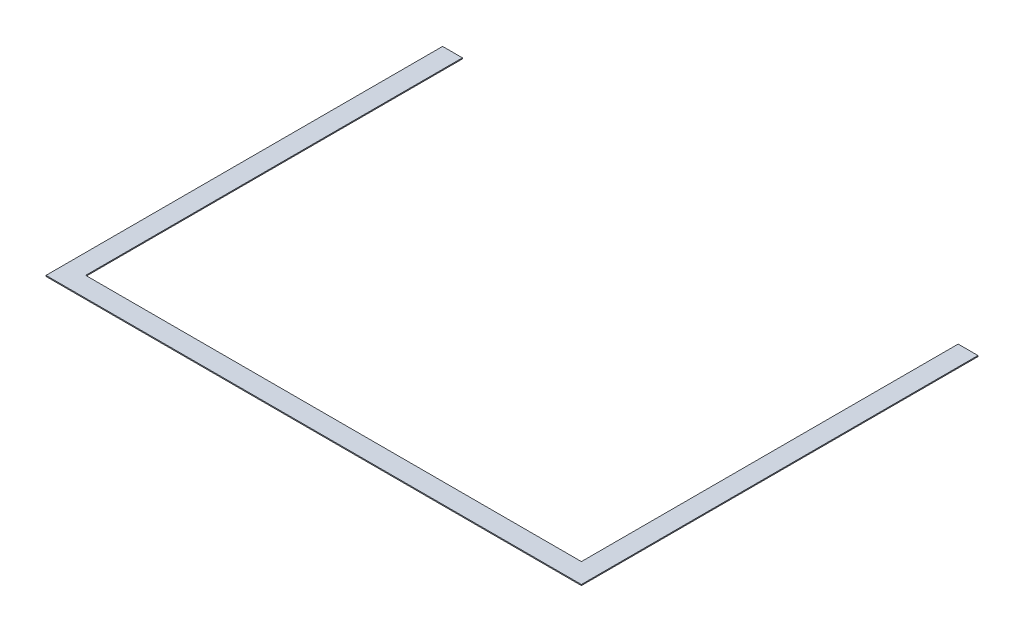
ISO-10303-21;
HEADER;
FILE_DESCRIPTION(('STEP AP214'),'2;1');
FILE_NAME('part.step','',(''),(''),'','','');
FILE_SCHEMA(('AUTOMOTIVE_DESIGN { 1 0 10303 214 1 1 1 1 }'));
ENDSEC;
DATA;
#1=APPLICATION_CONTEXT('core data for automotive mechanical design processes');
#2=APPLICATION_PROTOCOL_DEFINITION('international standard','automotive_design',2000,#1);
#3=PRODUCT_CONTEXT('',#1,'mechanical');
#4=PRODUCT('Part','Part','',(#3));
#5=PRODUCT_RELATED_PRODUCT_CATEGORY('part','',(#4));
#6=PRODUCT_DEFINITION_FORMATION('','',#4);
#7=PRODUCT_DEFINITION_CONTEXT('part definition',#1,'design');
#8=PRODUCT_DEFINITION('design','',#6,#7);
#9=PRODUCT_DEFINITION_SHAPE('','',#8);
#10=(LENGTH_UNIT() NAMED_UNIT(*) SI_UNIT(.MILLI.,.METRE.));
#11=(NAMED_UNIT(*) PLANE_ANGLE_UNIT() SI_UNIT($,.RADIAN.));
#12=(NAMED_UNIT(*) SI_UNIT($,.STERADIAN.) SOLID_ANGLE_UNIT());
#13=UNCERTAINTY_MEASURE_WITH_UNIT(LENGTH_MEASURE(1.E-05),#10,'distance_accuracy_value','');
#14=(GEOMETRIC_REPRESENTATION_CONTEXT(3) GLOBAL_UNCERTAINTY_ASSIGNED_CONTEXT((#13)) GLOBAL_UNIT_ASSIGNED_CONTEXT((#10,
#11,#12)) REPRESENTATION_CONTEXT('',''));
#15=CARTESIAN_POINT('',(0.,0.,0.));
#16=DIRECTION('',(0.,0.,1.));
#17=DIRECTION('',(1.,0.,0.));
#18=AXIS2_PLACEMENT_3D('',#15,#16,#17);
#19=CARTESIAN_POINT('',(2493.37884073959,5.,-1936.62115926041));
#20=DIRECTION('',(0.,0.,1.));
#21=DIRECTION('',(1.,0.,0.));
#22=AXIS2_PLACEMENT_3D('',#19,#20,#21);
#23=PLANE('',#22);
#24=DIRECTION('',(-1.,0.,0.));
#25=VECTOR('',#24,1.);
#26=CARTESIAN_POINT('',(2493.37884073959,0.,-1936.62115926041));
#27=LINE('',#26,#25);
#28=CARTESIAN_POINT('',(2593.37884073959,0.,-1936.62115926041));
#29=VERTEX_POINT('',#28);
#30=CARTESIAN_POINT('',(2493.37884073959,0.,-1936.62115926041));
#31=VERTEX_POINT('',#30);
#32=EDGE_CURVE('E146',#29,#31,#27,.T.);
#33=ORIENTED_EDGE('',*,*,#32,.T.);
#34=DIRECTION('',(0.,-1.,0.));
#35=VECTOR('',#34,1.);
#36=CARTESIAN_POINT('',(2493.37884073959,5.,-1936.62115926041));
#37=LINE('',#36,#35);
#38=CARTESIAN_POINT('',(2493.37884073959,5.,-1936.62115926041));
#39=VERTEX_POINT('',#38);
#40=EDGE_CURVE('E11',#39,#31,#37,.T.);
#41=ORIENTED_EDGE('',*,*,#40,.F.);
#42=DIRECTION('',(-1.,0.,0.));
#43=VECTOR('',#42,1.);
#44=CARTESIAN_POINT('',(2493.37884073959,5.,-1936.62115926041));
#45=LINE('',#44,#43);
#46=CARTESIAN_POINT('',(2593.37884073959,5.,-1936.62115926041));
#47=VERTEX_POINT('',#46);
#48=EDGE_CURVE('E168',#47,#39,#45,.T.);
#49=ORIENTED_EDGE('',*,*,#48,.F.);
#50=DIRECTION('',(0.,-1.,0.));
#51=VECTOR('',#50,1.);
#52=CARTESIAN_POINT('',(2593.37884073959,5.,-1936.62115926041));
#53=LINE('',#52,#51);
#54=EDGE_CURVE('E142',#47,#29,#53,.T.);
#55=ORIENTED_EDGE('',*,*,#54,.T.);
#56=EDGE_LOOP('',(#33,#41,#49,#55));
#57=FACE_BOUND('',#56,.T.);
#58=ADVANCED_FACE('F45',(#57),#23,.F.);
#59=CARTESIAN_POINT('',(2493.37884073959,5.,-36.6211592604097));
#60=DIRECTION('',(1.,0.,0.));
#61=DIRECTION('',(0.,0.,-1.));
#62=AXIS2_PLACEMENT_3D('',#59,#60,#61);
#63=PLANE('',#62);
#64=DIRECTION('',(0.,0.,1.));
#65=VECTOR('',#64,1.);
#66=CARTESIAN_POINT('',(2493.37884073959,0.,-36.6211592604097));
#67=LINE('',#66,#65);
#68=CARTESIAN_POINT('',(2493.37884073959,0.,-36.6211592604097));
#69=VERTEX_POINT('',#68);
#70=EDGE_CURVE('E150',#31,#69,#67,.T.);
#71=ORIENTED_EDGE('',*,*,#70,.T.);
#72=DIRECTION('',(0.,-1.,0.));
#73=VECTOR('',#72,1.);
#74=CARTESIAN_POINT('',(2493.37884073959,5.,-36.6211592604097));
#75=LINE('',#74,#73);
#76=CARTESIAN_POINT('',(2493.37884073959,5.,-36.6211592604097));
#77=VERTEX_POINT('',#76);
#78=EDGE_CURVE('E54',#77,#69,#75,.T.);
#79=ORIENTED_EDGE('',*,*,#78,.F.);
#80=DIRECTION('',(0.,0.,1.));
#81=VECTOR('',#80,1.);
#82=CARTESIAN_POINT('',(2493.37884073959,5.,-186.62115926041));
#83=LINE('',#82,#81);
#84=EDGE_CURVE('E105',#39,#77,#83,.T.);
#85=ORIENTED_EDGE('',*,*,#84,.F.);
#86=ORIENTED_EDGE('',*,*,#40,.T.);
#87=EDGE_LOOP('',(#71,#79,#85,#86));
#88=FACE_BOUND('',#87,.T.);
#89=ADVANCED_FACE('F214',(#88),#63,.F.);
#90=CARTESIAN_POINT('',(-6.62115926040992,5.,-36.6211592604097));
#91=DIRECTION('',(0.,0.,1.));
#92=DIRECTION('',(1.,0.,0.));
#93=AXIS2_PLACEMENT_3D('',#90,#91,#92);
#94=PLANE('',#93);
#95=DIRECTION('',(-1.,0.,0.));
#96=VECTOR('',#95,1.);
#97=CARTESIAN_POINT('',(-6.62115926040992,0.,-36.6211592604097));
#98=LINE('',#97,#96);
#99=CARTESIAN_POINT('',(-6.62115926040992,0.,-36.6211592604097));
#100=VERTEX_POINT('',#99);
#101=EDGE_CURVE('E153',#69,#100,#98,.T.);
#102=ORIENTED_EDGE('',*,*,#101,.T.);
#103=DIRECTION('',(0.,-1.,0.));
#104=VECTOR('',#103,1.);
#105=CARTESIAN_POINT('',(-6.62115926040992,5.,-36.6211592604097));
#106=LINE('',#105,#104);
#107=CARTESIAN_POINT('',(-6.62115926040992,5.,-36.6211592604097));
#108=VERTEX_POINT('',#107);
#109=EDGE_CURVE('E179',#108,#100,#106,.T.);
#110=ORIENTED_EDGE('',*,*,#109,.F.);
#111=DIRECTION('',(-1.,0.,0.));
#112=VECTOR('',#111,1.);
#113=CARTESIAN_POINT('',(-6.62115926040992,5.,-36.6211592604097));
#114=LINE('',#113,#112);
#115=EDGE_CURVE('E189',#77,#108,#114,.T.);
#116=ORIENTED_EDGE('',*,*,#115,.F.);
#117=ORIENTED_EDGE('',*,*,#78,.T.);
#118=EDGE_LOOP('',(#102,#110,#116,#117));
#119=FACE_BOUND('',#118,.T.);
#120=ADVANCED_FACE('F187',(#119),#94,.F.);
#121=CARTESIAN_POINT('',(-6.62115926040992,5.,-36.6211592604097));
#122=DIRECTION('',(-1.,0.,0.));
#123=DIRECTION('',(0.,0.,1.));
#124=AXIS2_PLACEMENT_3D('',#121,#122,#123);
#125=PLANE('',#124);
#126=DIRECTION('',(0.,0.,-1.));
#127=VECTOR('',#126,1.);
#128=CARTESIAN_POINT('',(-6.62115926040992,0.,-36.6211592604097));
#129=LINE('',#128,#127);
#130=CARTESIAN_POINT('',(-6.62115926040992,0.,-1936.62115926041));
#131=VERTEX_POINT('',#130);
#132=EDGE_CURVE('E156',#100,#131,#129,.T.);
#133=ORIENTED_EDGE('',*,*,#132,.T.);
#134=DIRECTION('',(0.,-1.,0.));
#135=VECTOR('',#134,1.);
#136=CARTESIAN_POINT('',(-6.62115926040992,5.,-1936.62115926041));
#137=LINE('',#136,#135);
#138=CARTESIAN_POINT('',(-6.62115926040992,5.,-1936.62115926041));
#139=VERTEX_POINT('',#138);
#140=EDGE_CURVE('E175',#139,#131,#137,.T.);
#141=ORIENTED_EDGE('',*,*,#140,.F.);
#142=DIRECTION('',(0.,0.,-1.));
#143=VECTOR('',#142,1.);
#144=CARTESIAN_POINT('',(-6.62115926040992,5.,-36.6211592604097));
#145=LINE('',#144,#143);
#146=EDGE_CURVE('E202',#108,#139,#145,.T.);
#147=ORIENTED_EDGE('',*,*,#146,.F.);
#148=ORIENTED_EDGE('',*,*,#109,.T.);
#149=EDGE_LOOP('',(#133,#141,#147,#148));
#150=FACE_BOUND('',#149,.T.);
#151=ADVANCED_FACE('F197',(#150),#125,.F.);
#152=CARTESIAN_POINT('',(-106.62115926041,5.,-1936.62115926041));
#153=DIRECTION('',(0.,0.,1.));
#154=DIRECTION('',(1.,0.,0.));
#155=AXIS2_PLACEMENT_3D('',#152,#153,#154);
#156=PLANE('',#155);
#157=DIRECTION('',(-1.,0.,0.));
#158=VECTOR('',#157,1.);
#159=CARTESIAN_POINT('',(-106.62115926041,0.,-1936.62115926041));
#160=LINE('',#159,#158);
#161=CARTESIAN_POINT('',(-106.62115926041,0.,-1936.62115926041));
#162=VERTEX_POINT('',#161);
#163=EDGE_CURVE('E159',#131,#162,#160,.T.);
#164=ORIENTED_EDGE('',*,*,#163,.T.);
#165=DIRECTION('',(0.,-1.,0.));
#166=VECTOR('',#165,1.);
#167=CARTESIAN_POINT('',(-106.62115926041,5.,-1936.62115926041));
#168=LINE('',#167,#166);
#169=CARTESIAN_POINT('',(-106.62115926041,5.,-1936.62115926041));
#170=VERTEX_POINT('',#169);
#171=EDGE_CURVE('E135',#170,#162,#168,.T.);
#172=ORIENTED_EDGE('',*,*,#171,.F.);
#173=DIRECTION('',(-1.,0.,0.));
#174=VECTOR('',#173,1.);
#175=CARTESIAN_POINT('',(-106.62115926041,5.,-1936.62115926041));
#176=LINE('',#175,#174);
#177=EDGE_CURVE('E124',#139,#170,#176,.T.);
#178=ORIENTED_EDGE('',*,*,#177,.F.);
#179=ORIENTED_EDGE('',*,*,#140,.T.);
#180=EDGE_LOOP('',(#164,#172,#178,#179));
#181=FACE_BOUND('',#180,.T.);
#182=ADVANCED_FACE('F200',(#181),#156,.F.);
#183=CARTESIAN_POINT('',(-106.62115926041,5.,63.3788407395903));
#184=DIRECTION('',(1.,0.,0.));
#185=DIRECTION('',(0.,0.,-1.));
#186=AXIS2_PLACEMENT_3D('',#183,#184,#185);
#187=PLANE('',#186);
#188=DIRECTION('',(0.,0.,1.));
#189=VECTOR('',#188,1.);
#190=CARTESIAN_POINT('',(-106.62115926041,0.,63.3788407395903));
#191=LINE('',#190,#189);
#192=CARTESIAN_POINT('',(-106.62115926041,0.,63.3788407395903));
#193=VERTEX_POINT('',#192);
#194=EDGE_CURVE('E133',#162,#193,#191,.T.);
#195=ORIENTED_EDGE('',*,*,#194,.T.);
#196=DIRECTION('',(0.,-1.,0.));
#197=VECTOR('',#196,1.);
#198=CARTESIAN_POINT('',(-106.62115926041,5.,63.3788407395903));
#199=LINE('',#198,#197);
#200=CARTESIAN_POINT('',(-106.62115926041,5.,63.3788407395903));
#201=VERTEX_POINT('',#200);
#202=EDGE_CURVE('E130',#201,#193,#199,.T.);
#203=ORIENTED_EDGE('',*,*,#202,.F.);
#204=DIRECTION('',(0.,0.,1.));
#205=VECTOR('',#204,1.);
#206=CARTESIAN_POINT('',(-106.62115926041,5.,63.3788407395903));
#207=LINE('',#206,#205);
#208=EDGE_CURVE('E118',#170,#201,#207,.T.);
#209=ORIENTED_EDGE('',*,*,#208,.F.);
#210=ORIENTED_EDGE('',*,*,#171,.T.);
#211=EDGE_LOOP('',(#195,#203,#209,#210));
#212=FACE_BOUND('',#211,.T.);
#213=ADVANCED_FACE('F131',(#212),#187,.F.);
#214=CARTESIAN_POINT('',(-106.62115926041,5.,63.3788407395903));
#215=DIRECTION('',(0.,0.,-1.));
#216=DIRECTION('',(-1.,0.,0.));
#217=AXIS2_PLACEMENT_3D('',#214,#215,#216);
#218=PLANE('',#217);
#219=DIRECTION('',(1.,0.,0.));
#220=VECTOR('',#219,1.);
#221=CARTESIAN_POINT('',(-106.62115926041,0.,63.3788407395903));
#222=LINE('',#221,#220);
#223=CARTESIAN_POINT('',(2593.37884073959,0.,63.3788407395903));
#224=VERTEX_POINT('',#223);
#225=EDGE_CURVE('E91',#193,#224,#222,.T.);
#226=ORIENTED_EDGE('',*,*,#225,.T.);
#227=DIRECTION('',(0.,-1.,0.));
#228=VECTOR('',#227,1.);
#229=CARTESIAN_POINT('',(2593.37884073959,5.,63.3788407395903));
#230=LINE('',#229,#228);
#231=CARTESIAN_POINT('',(2593.37884073959,5.,63.3788407395903));
#232=VERTEX_POINT('',#231);
#233=EDGE_CURVE('E136',#232,#224,#230,.T.);
#234=ORIENTED_EDGE('',*,*,#233,.F.);
#235=DIRECTION('',(1.,0.,0.));
#236=VECTOR('',#235,1.);
#237=CARTESIAN_POINT('',(-106.62115926041,5.,63.3788407395903));
#238=LINE('',#237,#236);
#239=EDGE_CURVE('E122',#201,#232,#238,.T.);
#240=ORIENTED_EDGE('',*,*,#239,.F.);
#241=ORIENTED_EDGE('',*,*,#202,.T.);
#242=EDGE_LOOP('',(#226,#234,#240,#241));
#243=FACE_BOUND('',#242,.T.);
#244=ADVANCED_FACE('F138',(#243),#218,.F.);
#245=CARTESIAN_POINT('',(2593.37884073959,5.,63.3788407395903));
#246=DIRECTION('',(-1.,0.,0.));
#247=DIRECTION('',(0.,0.,1.));
#248=AXIS2_PLACEMENT_3D('',#245,#246,#247);
#249=PLANE('',#248);
#250=DIRECTION('',(0.,0.,-1.));
#251=VECTOR('',#250,1.);
#252=CARTESIAN_POINT('',(2593.37884073959,0.,63.3788407395903));
#253=LINE('',#252,#251);
#254=EDGE_CURVE('E97',#224,#29,#253,.T.);
#255=ORIENTED_EDGE('',*,*,#254,.T.);
#256=ORIENTED_EDGE('',*,*,#54,.F.);
#257=DIRECTION('',(0.,0.,-1.));
#258=VECTOR('',#257,1.);
#259=CARTESIAN_POINT('',(2593.37884073959,5.,63.3788407395903));
#260=LINE('',#259,#258);
#261=EDGE_CURVE('E62',#232,#47,#260,.T.);
#262=ORIENTED_EDGE('',*,*,#261,.F.);
#263=ORIENTED_EDGE('',*,*,#233,.T.);
#264=EDGE_LOOP('',(#255,#256,#262,#263));
#265=FACE_BOUND('',#264,.T.);
#266=ADVANCED_FACE('F230',(#265),#249,.F.);
#267=CARTESIAN_POINT('',(0.,5.,0.));
#268=DIRECTION('',(0.,1.,0.));
#269=DIRECTION('',(0.,0.,1.));
#270=AXIS2_PLACEMENT_3D('',#267,#268,#269);
#271=PLANE('',#270);
#272=ORIENTED_EDGE('',*,*,#48,.T.);
#273=ORIENTED_EDGE('',*,*,#84,.T.);
#274=ORIENTED_EDGE('',*,*,#115,.T.);
#275=ORIENTED_EDGE('',*,*,#146,.T.);
#276=ORIENTED_EDGE('',*,*,#177,.T.);
#277=ORIENTED_EDGE('',*,*,#208,.T.);
#278=ORIENTED_EDGE('',*,*,#239,.T.);
#279=ORIENTED_EDGE('',*,*,#261,.T.);
#280=EDGE_LOOP('',(#272,#273,#274,#275,#276,#277,#278,#279));
#281=FACE_BOUND('',#280,.T.);
#282=ADVANCED_FACE('F120',(#281),#271,.T.);
#283=CARTESIAN_POINT('',(0.,0.,0.));
#284=DIRECTION('',(0.,1.,0.));
#285=DIRECTION('',(0.,0.,1.));
#286=AXIS2_PLACEMENT_3D('',#283,#284,#285);
#287=PLANE('',#286);
#288=ORIENTED_EDGE('',*,*,#32,.F.);
#289=ORIENTED_EDGE('',*,*,#254,.F.);
#290=ORIENTED_EDGE('',*,*,#225,.F.);
#291=ORIENTED_EDGE('',*,*,#194,.F.);
#292=ORIENTED_EDGE('',*,*,#163,.F.);
#293=ORIENTED_EDGE('',*,*,#132,.F.);
#294=ORIENTED_EDGE('',*,*,#101,.F.);
#295=ORIENTED_EDGE('',*,*,#70,.F.);
#296=EDGE_LOOP('',(#288,#289,#290,#291,#292,#293,#294,#295));
#297=FACE_BOUND('',#296,.T.);
#298=ADVANCED_FACE('F193',(#297),#287,.F.);
#299=CLOSED_SHELL('',(#58,#89,#120,#151,#182,#213,#244,#266,#282,#298));
#300=MANIFOLD_SOLID_BREP('B2',#299);
#301=ADVANCED_BREP_SHAPE_REPRESENTATION('',(#18,#300),#14);
#302=SHAPE_DEFINITION_REPRESENTATION(#9,#301);
ENDSEC;
END-ISO-10303-21;
